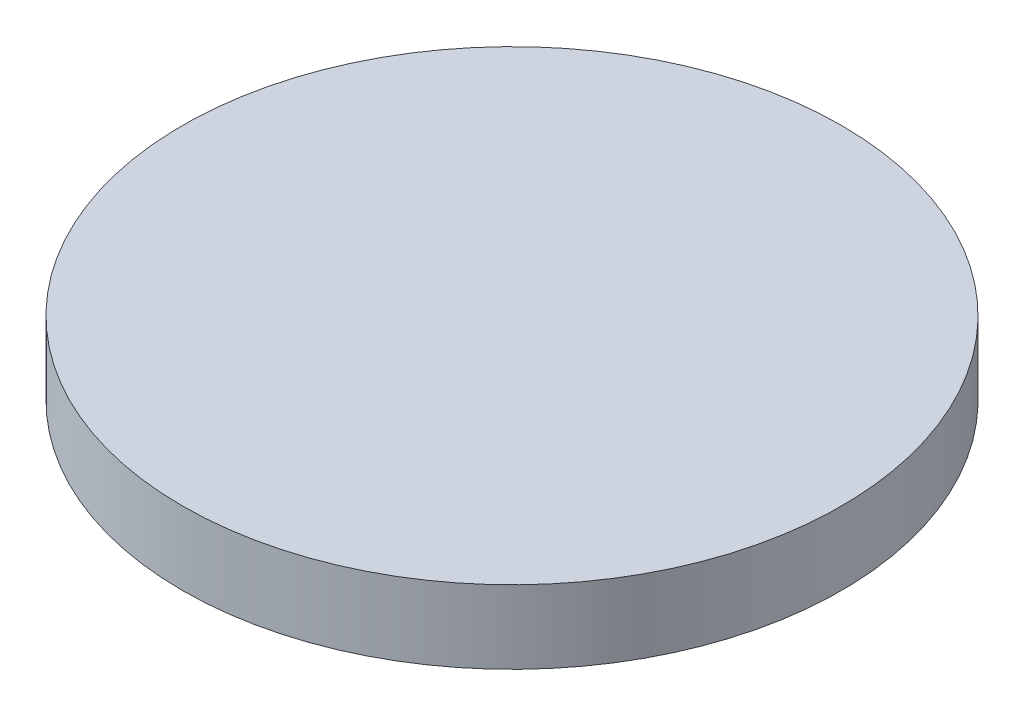
ISO-10303-21;
HEADER;
FILE_DESCRIPTION(('STEP AP214'),'2;1');
FILE_NAME('part.step','',(''),(''),'','','');
FILE_SCHEMA(('AUTOMOTIVE_DESIGN { 1 0 10303 214 1 1 1 1 }'));
ENDSEC;
DATA;
#1=APPLICATION_CONTEXT('core data for automotive mechanical design processes');
#2=APPLICATION_PROTOCOL_DEFINITION('international standard','automotive_design',2000,#1);
#3=PRODUCT_CONTEXT('',#1,'mechanical');
#4=PRODUCT('Part','Part','',(#3));
#5=PRODUCT_RELATED_PRODUCT_CATEGORY('part','',(#4));
#6=PRODUCT_DEFINITION_FORMATION('','',#4);
#7=PRODUCT_DEFINITION_CONTEXT('part definition',#1,'design');
#8=PRODUCT_DEFINITION('design','',#6,#7);
#9=PRODUCT_DEFINITION_SHAPE('','',#8);
#10=(LENGTH_UNIT() NAMED_UNIT(*) SI_UNIT(.MILLI.,.METRE.));
#11=(NAMED_UNIT(*) PLANE_ANGLE_UNIT() SI_UNIT($,.RADIAN.));
#12=(NAMED_UNIT(*) SI_UNIT($,.STERADIAN.) SOLID_ANGLE_UNIT());
#13=UNCERTAINTY_MEASURE_WITH_UNIT(LENGTH_MEASURE(1.E-05),#10,'distance_accuracy_value','');
#14=(GEOMETRIC_REPRESENTATION_CONTEXT(3) GLOBAL_UNCERTAINTY_ASSIGNED_CONTEXT((#13)) GLOBAL_UNIT_ASSIGNED_CONTEXT((#10,
#11,#12)) REPRESENTATION_CONTEXT('',''));
#15=CARTESIAN_POINT('',(0.,0.,0.));
#16=DIRECTION('',(0.,0.,1.));
#17=DIRECTION('',(1.,0.,0.));
#18=AXIS2_PLACEMENT_3D('',#15,#16,#17);
#19=CARTESIAN_POINT('',(0.,9.5,0.));
#20=DIRECTION('',(0.,-1.,0.));
#21=DIRECTION('',(0.,0.,-1.));
#22=AXIS2_PLACEMENT_3D('',#19,#20,#21);
#23=PLANE('',#22);
#24=CARTESIAN_POINT('',(0.,9.5,0.));
#25=DIRECTION('',(0.,-1.,0.));
#26=DIRECTION('',(0.,0.,-1.));
#27=AXIS2_PLACEMENT_3D('',#24,#25,#26);
#28=CIRCLE('',#27,18.);
#29=CARTESIAN_POINT('',(0.,9.5,-18.));
#30=VERTEX_POINT('',#29);
#31=EDGE_CURVE('E17',#30,#30,#28,.F.);
#32=ORIENTED_EDGE('',*,*,#31,.F.);
#33=EDGE_LOOP('',(#32));
#34=FACE_BOUND('',#33,.T.);
#35=ADVANCED_FACE('F14',(#34),#23,.T.);
#36=CARTESIAN_POINT('',(0.,13.5,0.));
#37=DIRECTION('',(0.,-1.,0.));
#38=DIRECTION('',(0.,0.,-1.));
#39=AXIS2_PLACEMENT_3D('',#36,#37,#38);
#40=CYLINDRICAL_SURFACE('',#39,18.);
#41=ORIENTED_EDGE('',*,*,#31,.T.);
#42=EDGE_LOOP('',(#41));
#43=FACE_BOUND('',#42,.T.);
#44=CARTESIAN_POINT('',(0.,13.5,0.));
#45=DIRECTION('',(0.,-1.,0.));
#46=DIRECTION('',(0.,0.,-1.));
#47=AXIS2_PLACEMENT_3D('',#44,#45,#46);
#48=CIRCLE('',#47,18.);
#49=CARTESIAN_POINT('',(0.,13.5,-18.));
#50=VERTEX_POINT('',#49);
#51=EDGE_CURVE('E10',#50,#50,#48,.T.);
#52=ORIENTED_EDGE('',*,*,#51,.T.);
#53=EDGE_LOOP('',(#52));
#54=FACE_BOUND('',#53,.T.);
#55=ADVANCED_FACE('F26',(#43,#54),#40,.T.);
#56=CARTESIAN_POINT('',(0.,13.5,0.));
#57=DIRECTION('',(0.,-1.,0.));
#58=DIRECTION('',(0.,0.,-1.));
#59=AXIS2_PLACEMENT_3D('',#56,#57,#58);
#60=PLANE('',#59);
#61=ORIENTED_EDGE('',*,*,#51,.F.);
#62=EDGE_LOOP('',(#61));
#63=FACE_BOUND('',#62,.T.);
#64=ADVANCED_FACE('F33',(#63),#60,.F.);
#65=CLOSED_SHELL('',(#35,#55,#64));
#66=MANIFOLD_SOLID_BREP('B1',#65);
#67=ADVANCED_BREP_SHAPE_REPRESENTATION('',(#18,#66),#14);
#68=SHAPE_DEFINITION_REPRESENTATION(#9,#67);
ENDSEC;
END-ISO-10303-21;
